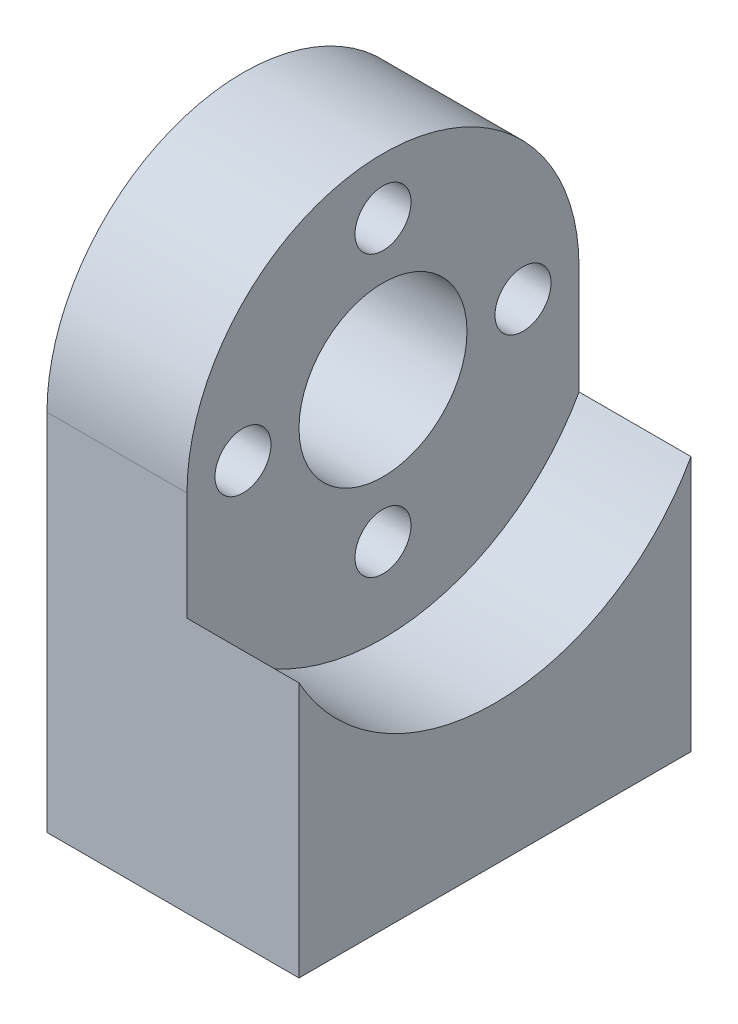
ISO-10303-21;
HEADER;
FILE_DESCRIPTION(('STEP AP214'),'2;1');
FILE_NAME('part.step','',(''),(''),'','','');
FILE_SCHEMA(('AUTOMOTIVE_DESIGN { 1 0 10303 214 1 1 1 1 }'));
ENDSEC;
DATA;
#1=APPLICATION_CONTEXT('core data for automotive mechanical design processes');
#2=APPLICATION_PROTOCOL_DEFINITION('international standard','automotive_design',2000,#1);
#3=PRODUCT_CONTEXT('',#1,'mechanical');
#4=PRODUCT('Part','Part','',(#3));
#5=PRODUCT_RELATED_PRODUCT_CATEGORY('part','',(#4));
#6=PRODUCT_DEFINITION_FORMATION('','',#4);
#7=PRODUCT_DEFINITION_CONTEXT('part definition',#1,'design');
#8=PRODUCT_DEFINITION('design','',#6,#7);
#9=PRODUCT_DEFINITION_SHAPE('','',#8);
#10=(LENGTH_UNIT() NAMED_UNIT(*) SI_UNIT(.MILLI.,.METRE.));
#11=(NAMED_UNIT(*) PLANE_ANGLE_UNIT() SI_UNIT($,.RADIAN.));
#12=(NAMED_UNIT(*) SI_UNIT($,.STERADIAN.) SOLID_ANGLE_UNIT());
#13=UNCERTAINTY_MEASURE_WITH_UNIT(LENGTH_MEASURE(1.E-05),#10,'distance_accuracy_value','');
#14=(GEOMETRIC_REPRESENTATION_CONTEXT(3) GLOBAL_UNCERTAINTY_ASSIGNED_CONTEXT((#13)) GLOBAL_UNIT_ASSIGNED_CONTEXT((#10,
#11,#12)) REPRESENTATION_CONTEXT('',''));
#15=CARTESIAN_POINT('',(0.,0.,0.));
#16=DIRECTION('',(0.,0.,1.));
#17=DIRECTION('',(1.,0.,0.));
#18=AXIS2_PLACEMENT_3D('',#15,#16,#17);
#19=CARTESIAN_POINT('',(0.,13.,-7.));
#20=DIRECTION('',(-1.,0.,0.));
#21=DIRECTION('',(0.,0.,1.));
#22=AXIS2_PLACEMENT_3D('',#19,#20,#21);
#23=PLANE('',#22);
#24=CARTESIAN_POINT('',(0.,13.,-7.));
#25=DIRECTION('',(1.,0.,0.));
#26=DIRECTION('',(0.,0.,1.));
#27=AXIS2_PLACEMENT_3D('',#24,#25,#26);
#28=CIRCLE('',#27,7.);
#29=CARTESIAN_POINT('',(0.,13.,-14.));
#30=VERTEX_POINT('',#29);
#31=CARTESIAN_POINT('',(0.,20.,-6.99999999999998));
#32=VERTEX_POINT('',#31);
#33=EDGE_CURVE('E159',#30,#32,#28,.T.);
#34=ORIENTED_EDGE('',*,*,#33,.F.);
#35=CARTESIAN_POINT('',(0.,13.,-12.));
#36=DIRECTION('',(-1.,0.,0.));
#37=DIRECTION('',(0.,0.,1.));
#38=AXIS2_PLACEMENT_3D('',#35,#36,#37);
#39=CIRCLE('',#38,2.00000000000001);
#40=CARTESIAN_POINT('',(0.,13.,-10.));
#41=VERTEX_POINT('',#40);
#42=EDGE_CURVE('E204',#30,#41,#39,.F.);
#43=ORIENTED_EDGE('',*,*,#42,.T.);
#44=CARTESIAN_POINT('',(0.,13.,-7.));
#45=DIRECTION('',(1.,0.,0.));
#46=DIRECTION('',(0.,0.,-1.));
#47=AXIS2_PLACEMENT_3D('',#44,#45,#46);
#48=CIRCLE('',#47,3.);
#49=CARTESIAN_POINT('',(0.,16.,-6.99999999999999));
#50=VERTEX_POINT('',#49);
#51=EDGE_CURVE('E146',#41,#50,#48,.T.);
#52=ORIENTED_EDGE('',*,*,#51,.T.);
#53=CARTESIAN_POINT('',(0.,18.,-6.99999999999999));
#54=DIRECTION('',(-1.,0.,0.));
#55=DIRECTION('',(0.,0.,1.));
#56=AXIS2_PLACEMENT_3D('',#53,#54,#55);
#57=CIRCLE('',#56,2.);
#58=EDGE_CURVE('E48',#50,#32,#57,.F.);
#59=ORIENTED_EDGE('',*,*,#58,.T.);
#60=EDGE_LOOP('',(#34,#43,#52,#59));
#61=FACE_BOUND('',#60,.T.);
#62=ADVANCED_FACE('F33',(#61),#23,.T.);
#63=CARTESIAN_POINT('',(0.,13.,-4.));
#64=VERTEX_POINT('',#63);
#65=CARTESIAN_POINT('',(0.,10.,-7.00000000000003));
#66=VERTEX_POINT('',#65);
#67=EDGE_CURVE('E232',#64,#66,#48,.T.);
#68=ORIENTED_EDGE('',*,*,#67,.T.);
#69=CARTESIAN_POINT('',(0.,8.,-7.00000000000005));
#70=DIRECTION('',(-1.,0.,0.));
#71=DIRECTION('',(0.,0.,1.));
#72=AXIS2_PLACEMENT_3D('',#69,#70,#71);
#73=CIRCLE('',#72,2.00000000000001);
#74=EDGE_CURVE('E54',#66,#66,#73,.F.);
#75=ORIENTED_EDGE('',*,*,#74,.T.);
#76=EDGE_CURVE('E145',#66,#41,#48,.T.);
#77=ORIENTED_EDGE('',*,*,#76,.T.);
#78=CARTESIAN_POINT('',(0.,13.,-12.));
#79=DIRECTION('',(-1.,0.,0.));
#80=DIRECTION('',(0.,0.,1.));
#81=AXIS2_PLACEMENT_3D('',#78,#79,#80);
#82=CIRCLE('',#81,2.00000000000001);
#83=EDGE_CURVE('E202',#41,#30,#82,.F.);
#84=ORIENTED_EDGE('',*,*,#83,.T.);
#85=DIRECTION('',(0.,1.,0.));
#86=VECTOR('',#85,1.);
#87=CARTESIAN_POINT('',(0.,0.,-14.));
#88=LINE('',#87,#86);
#89=CARTESIAN_POINT('',(0.,0.,-14.));
#90=VERTEX_POINT('',#89);
#91=EDGE_CURVE('E153',#90,#30,#88,.T.);
#92=ORIENTED_EDGE('',*,*,#91,.F.);
#93=DIRECTION('',(0.,0.,-1.));
#94=VECTOR('',#93,1.);
#95=CARTESIAN_POINT('',(0.,0.,0.));
#96=LINE('',#95,#94);
#97=CARTESIAN_POINT('',(0.,0.,0.));
#98=VERTEX_POINT('',#97);
#99=EDGE_CURVE('E164',#98,#90,#96,.T.);
#100=ORIENTED_EDGE('',*,*,#99,.F.);
#101=DIRECTION('',(0.,-1.,0.));
#102=VECTOR('',#101,1.);
#103=CARTESIAN_POINT('',(0.,13.,0.));
#104=LINE('',#103,#102);
#105=CARTESIAN_POINT('',(0.,13.,0.));
#106=VERTEX_POINT('',#105);
#107=EDGE_CURVE('E162',#106,#98,#104,.T.);
#108=ORIENTED_EDGE('',*,*,#107,.F.);
#109=CARTESIAN_POINT('',(0.,13.,-2.));
#110=DIRECTION('',(-1.,0.,0.));
#111=DIRECTION('',(0.,0.,1.));
#112=AXIS2_PLACEMENT_3D('',#109,#110,#111);
#113=CIRCLE('',#112,2.00000000000001);
#114=EDGE_CURVE('E199',#106,#64,#113,.F.);
#115=ORIENTED_EDGE('',*,*,#114,.T.);
#116=EDGE_LOOP('',(#68,#75,#77,#84,#92,#100,#108,#115));
#117=FACE_BOUND('',#116,.T.);
#118=ADVANCED_FACE('F231',(#117),#23,.T.);
#119=CARTESIAN_POINT('',(9.,8.,-7.00000000000005));
#120=DIRECTION('',(-1.,0.,0.));
#121=DIRECTION('',(0.,1.,0.));
#122=AXIS2_PLACEMENT_3D('',#119,#120,#121);
#123=CYLINDRICAL_SURFACE('',#122,1.);
#124=CARTESIAN_POINT('',(1.00000000000001,8.,-7.00000000000005));
#125=DIRECTION('',(-1.,0.,0.));
#126=DIRECTION('',(0.,0.,1.));
#127=AXIS2_PLACEMENT_3D('',#124,#125,#126);
#128=CIRCLE('',#127,1.);
#129=CARTESIAN_POINT('',(1.00000000000001,8.,-6.00000000000005));
#130=VERTEX_POINT('',#129);
#131=EDGE_CURVE('E208',#130,#130,#128,.T.);
#132=ORIENTED_EDGE('',*,*,#131,.T.);
#133=EDGE_LOOP('',(#132));
#134=FACE_BOUND('',#133,.T.);
#135=CARTESIAN_POINT('',(5.,8.,-7.00000000000005));
#136=DIRECTION('',(1.,0.,0.));
#137=DIRECTION('',(0.,-1.,0.));
#138=AXIS2_PLACEMENT_3D('',#135,#136,#137);
#139=CIRCLE('',#138,1.);
#140=CARTESIAN_POINT('',(5.,6.99999999999999,-7.00000000000006));
#141=VERTEX_POINT('',#140);
#142=EDGE_CURVE('E190',#141,#141,#139,.T.);
#143=ORIENTED_EDGE('',*,*,#142,.T.);
#144=EDGE_LOOP('',(#143));
#145=FACE_BOUND('',#144,.T.);
#146=ADVANCED_FACE('F254',(#134,#145),#123,.F.);
#147=CARTESIAN_POINT('',(9.,13.,-2.));
#148=DIRECTION('',(-1.,0.,0.));
#149=DIRECTION('',(0.,0.,-1.));
#150=AXIS2_PLACEMENT_3D('',#147,#148,#149);
#151=CYLINDRICAL_SURFACE('',#150,1.);
#152=CARTESIAN_POINT('',(1.00000000000001,13.,-2.));
#153=DIRECTION('',(-1.,0.,0.));
#154=DIRECTION('',(0.,0.,1.));
#155=AXIS2_PLACEMENT_3D('',#152,#153,#154);
#156=CIRCLE('',#155,1.);
#157=CARTESIAN_POINT('',(1.00000000000001,13.,-0.999999999999999));
#158=VERTEX_POINT('',#157);
#159=EDGE_CURVE('E41',#158,#158,#156,.T.);
#160=ORIENTED_EDGE('',*,*,#159,.T.);
#161=EDGE_LOOP('',(#160));
#162=FACE_BOUND('',#161,.T.);
#163=CARTESIAN_POINT('',(5.,13.,-2.));
#164=DIRECTION('',(1.,0.,0.));
#165=DIRECTION('',(0.,0.,1.));
#166=AXIS2_PLACEMENT_3D('',#163,#164,#165);
#167=CIRCLE('',#166,1.);
#168=CARTESIAN_POINT('',(5.,13.,-0.999999999999999));
#169=VERTEX_POINT('',#168);
#170=EDGE_CURVE('E187',#169,#169,#167,.T.);
#171=ORIENTED_EDGE('',*,*,#170,.T.);
#172=EDGE_LOOP('',(#171));
#173=FACE_BOUND('',#172,.T.);
#174=ADVANCED_FACE('F216',(#162,#173),#151,.F.);
#175=CARTESIAN_POINT('',(9.,18.,-6.99999999999999));
#176=DIRECTION('',(-1.,0.,0.));
#177=DIRECTION('',(0.,-1.,0.));
#178=AXIS2_PLACEMENT_3D('',#175,#176,#177);
#179=CYLINDRICAL_SURFACE('',#178,1.);
#180=CARTESIAN_POINT('',(1.,18.,-6.99999999999999));
#181=DIRECTION('',(-1.,0.,0.));
#182=DIRECTION('',(0.,0.,1.));
#183=AXIS2_PLACEMENT_3D('',#180,#181,#182);
#184=CIRCLE('',#183,1.);
#185=CARTESIAN_POINT('',(1.,18.,-5.99999999999998));
#186=VERTEX_POINT('',#185);
#187=EDGE_CURVE('E11',#186,#186,#184,.T.);
#188=ORIENTED_EDGE('',*,*,#187,.T.);
#189=EDGE_LOOP('',(#188));
#190=FACE_BOUND('',#189,.T.);
#191=CARTESIAN_POINT('',(5.,18.,-6.99999999999999));
#192=DIRECTION('',(1.,0.,0.));
#193=DIRECTION('',(0.,1.,0.));
#194=AXIS2_PLACEMENT_3D('',#191,#192,#193);
#195=CIRCLE('',#194,1.);
#196=CARTESIAN_POINT('',(5.,19.,-6.99999999999998));
#197=VERTEX_POINT('',#196);
#198=EDGE_CURVE('E184',#197,#197,#195,.T.);
#199=ORIENTED_EDGE('',*,*,#198,.T.);
#200=EDGE_LOOP('',(#199));
#201=FACE_BOUND('',#200,.T.);
#202=ADVANCED_FACE('F371',(#190,#201),#179,.F.);
#203=CARTESIAN_POINT('',(9.,13.,-7.));
#204=DIRECTION('',(-1.,0.,0.));
#205=DIRECTION('',(0.,0.,1.));
#206=AXIS2_PLACEMENT_3D('',#203,#204,#205);
#207=CYLINDRICAL_SURFACE('',#206,7.);
#208=CARTESIAN_POINT('',(5.,13.,-7.));
#209=DIRECTION('',(1.,0.,0.));
#210=DIRECTION('',(0.,0.,-1.));
#211=AXIS2_PLACEMENT_3D('',#208,#209,#210);
#212=CIRCLE('',#211,7.);
#213=CARTESIAN_POINT('',(5.,13.,-14.));
#214=VERTEX_POINT('',#213);
#215=CARTESIAN_POINT('',(5.,13.,0.));
#216=VERTEX_POINT('',#215);
#217=EDGE_CURVE('E138',#214,#216,#212,.T.);
#218=ORIENTED_EDGE('',*,*,#217,.F.);
#219=DIRECTION('',(-1.,0.,0.));
#220=VECTOR('',#219,1.);
#221=CARTESIAN_POINT('',(9.,13.,-14.));
#222=LINE('',#221,#220);
#223=EDGE_CURVE('E158',#214,#30,#222,.T.);
#224=ORIENTED_EDGE('',*,*,#223,.T.);
#225=ORIENTED_EDGE('',*,*,#33,.T.);
#226=EDGE_CURVE('E148',#32,#106,#28,.T.);
#227=ORIENTED_EDGE('',*,*,#226,.T.);
#228=DIRECTION('',(-1.,0.,0.));
#229=VECTOR('',#228,1.);
#230=CARTESIAN_POINT('',(9.,13.,0.));
#231=LINE('',#230,#229);
#232=EDGE_CURVE('E176',#216,#106,#231,.T.);
#233=ORIENTED_EDGE('',*,*,#232,.F.);
#234=EDGE_LOOP('',(#218,#224,#225,#227,#233));
#235=FACE_BOUND('',#234,.T.);
#236=ADVANCED_FACE('F276',(#235),#207,.T.);
#237=CARTESIAN_POINT('',(9.,13.,-7.));
#238=DIRECTION('',(-1.,0.,0.));
#239=DIRECTION('',(0.,0.,1.));
#240=AXIS2_PLACEMENT_3D('',#237,#238,#239);
#241=CYLINDRICAL_SURFACE('',#240,3.);
#242=ORIENTED_EDGE('',*,*,#51,.F.);
#243=ORIENTED_EDGE('',*,*,#76,.F.);
#244=ORIENTED_EDGE('',*,*,#67,.F.);
#245=EDGE_CURVE('E149',#50,#64,#48,.T.);
#246=ORIENTED_EDGE('',*,*,#245,.F.);
#247=EDGE_LOOP('',(#242,#243,#244,#246));
#248=FACE_BOUND('',#247,.T.);
#249=CARTESIAN_POINT('',(5.,13.,-7.));
#250=DIRECTION('',(1.,0.,0.));
#251=DIRECTION('',(0.,0.,-1.));
#252=AXIS2_PLACEMENT_3D('',#249,#250,#251);
#253=CIRCLE('',#252,3.);
#254=CARTESIAN_POINT('',(5.,13.,-10.));
#255=VERTEX_POINT('',#254);
#256=EDGE_CURVE('E133',#255,#255,#253,.T.);
#257=ORIENTED_EDGE('',*,*,#256,.T.);
#258=EDGE_LOOP('',(#257));
#259=FACE_BOUND('',#258,.T.);
#260=ADVANCED_FACE('F238',(#248,#259),#241,.F.);
#261=CARTESIAN_POINT('',(9.,13.,-12.));
#262=DIRECTION('',(-1.,0.,0.));
#263=DIRECTION('',(0.,0.,1.));
#264=AXIS2_PLACEMENT_3D('',#261,#262,#263);
#265=CYLINDRICAL_SURFACE('',#264,1.);
#266=CARTESIAN_POINT('',(1.00000000000001,13.,-12.));
#267=DIRECTION('',(-1.,0.,0.));
#268=DIRECTION('',(0.,0.,1.));
#269=AXIS2_PLACEMENT_3D('',#266,#267,#268);
#270=CIRCLE('',#269,1.);
#271=CARTESIAN_POINT('',(1.00000000000001,13.,-11.));
#272=VERTEX_POINT('',#271);
#273=EDGE_CURVE('E211',#272,#272,#270,.T.);
#274=ORIENTED_EDGE('',*,*,#273,.T.);
#275=EDGE_LOOP('',(#274));
#276=FACE_BOUND('',#275,.T.);
#277=CARTESIAN_POINT('',(5.,13.,-12.));
#278=DIRECTION('',(1.,0.,0.));
#279=DIRECTION('',(0.,0.,-1.));
#280=AXIS2_PLACEMENT_3D('',#277,#278,#279);
#281=CIRCLE('',#280,1.);
#282=CARTESIAN_POINT('',(5.,13.,-13.));
#283=VERTEX_POINT('',#282);
#284=EDGE_CURVE('E131',#283,#283,#281,.T.);
#285=ORIENTED_EDGE('',*,*,#284,.T.);
#286=EDGE_LOOP('',(#285));
#287=FACE_BOUND('',#286,.T.);
#288=ADVANCED_FACE('F267',(#276,#287),#265,.F.);
#289=CARTESIAN_POINT('',(9.,13.,-7.));
#290=DIRECTION('',(-1.,0.,0.));
#291=DIRECTION('',(0.,0.,1.));
#292=AXIS2_PLACEMENT_3D('',#289,#290,#291);
#293=PLANE('',#292);
#294=DIRECTION('',(0.,1.,0.));
#295=VECTOR('',#294,1.);
#296=CARTESIAN_POINT('',(9.,0.,-14.));
#297=LINE('',#296,#295);
#298=CARTESIAN_POINT('',(9.,0.,-14.));
#299=VERTEX_POINT('',#298);
#300=CARTESIAN_POINT('',(9.,9.12701665379258,-14.));
#301=VERTEX_POINT('',#300);
#302=EDGE_CURVE('E155',#299,#301,#297,.T.);
#303=ORIENTED_EDGE('',*,*,#302,.T.);
#304=CARTESIAN_POINT('',(9.,13.,-7.));
#305=DIRECTION('',(1.,0.,0.));
#306=DIRECTION('',(0.,0.,-1.));
#307=AXIS2_PLACEMENT_3D('',#304,#305,#306);
#308=CIRCLE('',#307,8.);
#309=CARTESIAN_POINT('',(9.,9.12701665379258,0.));
#310=VERTEX_POINT('',#309);
#311=EDGE_CURVE('E128',#310,#301,#308,.T.);
#312=ORIENTED_EDGE('',*,*,#311,.F.);
#313=DIRECTION('',(0.,-1.,0.));
#314=VECTOR('',#313,1.);
#315=CARTESIAN_POINT('',(9.,13.,0.));
#316=LINE('',#315,#314);
#317=CARTESIAN_POINT('',(9.,0.,0.));
#318=VERTEX_POINT('',#317);
#319=EDGE_CURVE('E150',#310,#318,#316,.T.);
#320=ORIENTED_EDGE('',*,*,#319,.T.);
#321=DIRECTION('',(0.,0.,-1.));
#322=VECTOR('',#321,1.);
#323=CARTESIAN_POINT('',(9.,0.,0.));
#324=LINE('',#323,#322);
#325=EDGE_CURVE('E152',#318,#299,#324,.T.);
#326=ORIENTED_EDGE('',*,*,#325,.T.);
#327=EDGE_LOOP('',(#303,#312,#320,#326));
#328=FACE_BOUND('',#327,.T.);
#329=ADVANCED_FACE('F259',(#328),#293,.F.);
#330=ORIENTED_EDGE('',*,*,#245,.T.);
#331=CARTESIAN_POINT('',(0.,13.,-2.));
#332=DIRECTION('',(-1.,0.,0.));
#333=DIRECTION('',(0.,0.,1.));
#334=AXIS2_PLACEMENT_3D('',#331,#332,#333);
#335=CIRCLE('',#334,2.00000000000001);
#336=EDGE_CURVE('E197',#64,#106,#335,.F.);
#337=ORIENTED_EDGE('',*,*,#336,.T.);
#338=ORIENTED_EDGE('',*,*,#226,.F.);
#339=CARTESIAN_POINT('',(0.,18.,-6.99999999999999));
#340=DIRECTION('',(-1.,0.,0.));
#341=DIRECTION('',(0.,0.,1.));
#342=AXIS2_PLACEMENT_3D('',#339,#340,#341);
#343=CIRCLE('',#342,2.);
#344=EDGE_CURVE('E194',#32,#50,#343,.F.);
#345=ORIENTED_EDGE('',*,*,#344,.T.);
#346=EDGE_LOOP('',(#330,#337,#338,#345));
#347=FACE_BOUND('',#346,.T.);
#348=ADVANCED_FACE('F241',(#347),#23,.T.);
#349=CARTESIAN_POINT('',(9.,13.,0.));
#350=DIRECTION('',(0.,0.,-1.));
#351=DIRECTION('',(0.,1.,0.));
#352=AXIS2_PLACEMENT_3D('',#349,#350,#351);
#353=PLANE('',#352);
#354=ORIENTED_EDGE('',*,*,#319,.F.);
#355=DIRECTION('',(1.,0.,0.));
#356=VECTOR('',#355,1.);
#357=CARTESIAN_POINT('',(5.,9.12701665379258,0.));
#358=LINE('',#357,#356);
#359=CARTESIAN_POINT('',(5.,9.12701665379258,0.));
#360=VERTEX_POINT('',#359);
#361=EDGE_CURVE('E142',#310,#360,#358,.F.);
#362=ORIENTED_EDGE('',*,*,#361,.T.);
#363=DIRECTION('',(0.,-1.,0.));
#364=VECTOR('',#363,1.);
#365=CARTESIAN_POINT('',(5.,13.,0.));
#366=LINE('',#365,#364);
#367=EDGE_CURVE('E140',#216,#360,#366,.T.);
#368=ORIENTED_EDGE('',*,*,#367,.F.);
#369=ORIENTED_EDGE('',*,*,#232,.T.);
#370=ORIENTED_EDGE('',*,*,#107,.T.);
#371=DIRECTION('',(-1.,0.,0.));
#372=VECTOR('',#371,1.);
#373=CARTESIAN_POINT('',(9.,0.,0.));
#374=LINE('',#373,#372);
#375=EDGE_CURVE('E173',#318,#98,#374,.T.);
#376=ORIENTED_EDGE('',*,*,#375,.F.);
#377=EDGE_LOOP('',(#354,#362,#368,#369,#370,#376));
#378=FACE_BOUND('',#377,.T.);
#379=ADVANCED_FACE('F258',(#378),#353,.F.);
#380=CARTESIAN_POINT('',(9.,0.,0.));
#381=DIRECTION('',(0.,1.,0.));
#382=DIRECTION('',(0.,0.,1.));
#383=AXIS2_PLACEMENT_3D('',#380,#381,#382);
#384=PLANE('',#383);
#385=CARTESIAN_POINT('',(7.,0.,-11.));
#386=DIRECTION('',(0.,-1.,0.));
#387=DIRECTION('',(0.,0.,-1.));
#388=AXIS2_PLACEMENT_3D('',#385,#386,#387);
#389=CIRCLE('',#388,1.);
#390=CARTESIAN_POINT('',(7.,0.,-12.));
#391=VERTEX_POINT('',#390);
#392=EDGE_CURVE('E321',#391,#391,#389,.T.);
#393=ORIENTED_EDGE('',*,*,#392,.F.);
#394=EDGE_LOOP('',(#393));
#395=FACE_BOUND('',#394,.T.);
#396=CARTESIAN_POINT('',(3.,0.,-3.));
#397=DIRECTION('',(0.,-1.,0.));
#398=DIRECTION('',(0.,0.,-1.));
#399=AXIS2_PLACEMENT_3D('',#396,#397,#398);
#400=CIRCLE('',#399,0.999999999999999);
#401=CARTESIAN_POINT('',(3.,0.,-4.));
#402=VERTEX_POINT('',#401);
#403=EDGE_CURVE('E320',#402,#402,#400,.T.);
#404=ORIENTED_EDGE('',*,*,#403,.F.);
#405=EDGE_LOOP('',(#404));
#406=FACE_BOUND('',#405,.T.);
#407=CARTESIAN_POINT('',(3.,0.,-11.));
#408=DIRECTION('',(0.,-1.,0.));
#409=DIRECTION('',(0.,0.,-1.));
#410=AXIS2_PLACEMENT_3D('',#407,#408,#409);
#411=CIRCLE('',#410,1.25);
#412=CARTESIAN_POINT('',(3.,0.,-12.25));
#413=VERTEX_POINT('',#412);
#414=EDGE_CURVE('E116',#413,#413,#411,.T.);
#415=ORIENTED_EDGE('',*,*,#414,.F.);
#416=EDGE_LOOP('',(#415));
#417=FACE_BOUND('',#416,.T.);
#418=CARTESIAN_POINT('',(7.,0.,-3.));
#419=DIRECTION('',(0.,-1.,0.));
#420=DIRECTION('',(0.,0.,-1.));
#421=AXIS2_PLACEMENT_3D('',#418,#419,#420);
#422=CIRCLE('',#421,1.25);
#423=CARTESIAN_POINT('',(7.,0.,-4.25));
#424=VERTEX_POINT('',#423);
#425=EDGE_CURVE('E115',#424,#424,#422,.T.);
#426=ORIENTED_EDGE('',*,*,#425,.F.);
#427=EDGE_LOOP('',(#426));
#428=FACE_BOUND('',#427,.T.);
#429=ORIENTED_EDGE('',*,*,#99,.T.);
#430=DIRECTION('',(-1.,0.,0.));
#431=VECTOR('',#430,1.);
#432=CARTESIAN_POINT('',(9.,0.,-14.));
#433=LINE('',#432,#431);
#434=EDGE_CURVE('E170',#299,#90,#433,.T.);
#435=ORIENTED_EDGE('',*,*,#434,.F.);
#436=ORIENTED_EDGE('',*,*,#325,.F.);
#437=ORIENTED_EDGE('',*,*,#375,.T.);
#438=EDGE_LOOP('',(#429,#435,#436,#437));
#439=FACE_BOUND('',#438,.T.);
#440=ADVANCED_FACE('F264',(#395,#406,#417,#428,#439),#384,.F.);
#441=CARTESIAN_POINT('',(9.,0.,-14.));
#442=DIRECTION('',(0.,0.,1.));
#443=DIRECTION('',(0.,-1.,0.));
#444=AXIS2_PLACEMENT_3D('',#441,#442,#443);
#445=PLANE('',#444);
#446=DIRECTION('',(0.,1.,0.));
#447=VECTOR('',#446,1.);
#448=CARTESIAN_POINT('',(5.,0.,-14.));
#449=LINE('',#448,#447);
#450=CARTESIAN_POINT('',(5.,9.12701665379258,-14.));
#451=VERTEX_POINT('',#450);
#452=EDGE_CURVE('E136',#451,#214,#449,.T.);
#453=ORIENTED_EDGE('',*,*,#452,.F.);
#454=DIRECTION('',(1.,0.,0.));
#455=VECTOR('',#454,1.);
#456=CARTESIAN_POINT('',(5.,9.12701665379258,-14.));
#457=LINE('',#456,#455);
#458=EDGE_CURVE('E179',#451,#301,#457,.T.);
#459=ORIENTED_EDGE('',*,*,#458,.T.);
#460=ORIENTED_EDGE('',*,*,#302,.F.);
#461=ORIENTED_EDGE('',*,*,#434,.T.);
#462=ORIENTED_EDGE('',*,*,#91,.T.);
#463=ORIENTED_EDGE('',*,*,#223,.F.);
#464=EDGE_LOOP('',(#453,#459,#460,#461,#462,#463));
#465=FACE_BOUND('',#464,.T.);
#466=ADVANCED_FACE('F282',(#465),#445,.F.);
#467=CARTESIAN_POINT('',(5.,13.,-7.));
#468=DIRECTION('',(1.,0.,0.));
#469=DIRECTION('',(0.,0.,-1.));
#470=AXIS2_PLACEMENT_3D('',#467,#468,#469);
#471=CYLINDRICAL_SURFACE('',#470,8.);
#472=ORIENTED_EDGE('',*,*,#311,.T.);
#473=ORIENTED_EDGE('',*,*,#458,.F.);
#474=CARTESIAN_POINT('',(5.,13.,-7.));
#475=DIRECTION('',(1.,0.,0.));
#476=DIRECTION('',(0.,0.,-1.));
#477=AXIS2_PLACEMENT_3D('',#474,#475,#476);
#478=CIRCLE('',#477,8.);
#479=EDGE_CURVE('E129',#360,#451,#478,.T.);
#480=ORIENTED_EDGE('',*,*,#479,.F.);
#481=ORIENTED_EDGE('',*,*,#361,.F.);
#482=EDGE_LOOP('',(#472,#473,#480,#481));
#483=FACE_BOUND('',#482,.T.);
#484=ADVANCED_FACE('F278',(#483),#471,.F.);
#485=CARTESIAN_POINT('',(5.,13.,-7.));
#486=DIRECTION('',(1.,0.,0.));
#487=DIRECTION('',(0.,0.,-1.));
#488=AXIS2_PLACEMENT_3D('',#485,#486,#487);
#489=PLANE('',#488);
#490=ORIENTED_EDGE('',*,*,#142,.F.);
#491=EDGE_LOOP('',(#490));
#492=FACE_BOUND('',#491,.T.);
#493=ORIENTED_EDGE('',*,*,#170,.F.);
#494=EDGE_LOOP('',(#493));
#495=FACE_BOUND('',#494,.T.);
#496=ORIENTED_EDGE('',*,*,#198,.F.);
#497=EDGE_LOOP('',(#496));
#498=FACE_BOUND('',#497,.T.);
#499=ORIENTED_EDGE('',*,*,#284,.F.);
#500=EDGE_LOOP('',(#499));
#501=FACE_BOUND('',#500,.T.);
#502=ORIENTED_EDGE('',*,*,#256,.F.);
#503=EDGE_LOOP('',(#502));
#504=FACE_BOUND('',#503,.T.);
#505=ORIENTED_EDGE('',*,*,#367,.T.);
#506=ORIENTED_EDGE('',*,*,#479,.T.);
#507=ORIENTED_EDGE('',*,*,#452,.T.);
#508=ORIENTED_EDGE('',*,*,#217,.T.);
#509=EDGE_LOOP('',(#505,#506,#507,#508));
#510=FACE_BOUND('',#509,.T.);
#511=ADVANCED_FACE('F281',(#492,#495,#498,#501,#504,#510),#489,.T.);
#512=CARTESIAN_POINT('',(7.,4.,-3.));
#513=DIRECTION('',(0.,-1.,0.));
#514=DIRECTION('',(0.,0.,-1.));
#515=AXIS2_PLACEMENT_3D('',#512,#513,#514);
#516=CONICAL_SURFACE('',#515,1.25,1.02974425867665);
#517=CARTESIAN_POINT('',(7.,4.75107577378445,-3.));
#518=VERTEX_POINT('',#517);
#519=VERTEX_LOOP('',#518);
#520=FACE_BOUND('',#519,.T.);
#521=CARTESIAN_POINT('',(7.,4.,-3.));
#522=DIRECTION('',(0.,-1.,0.));
#523=DIRECTION('',(0.,0.,-1.));
#524=AXIS2_PLACEMENT_3D('',#521,#522,#523);
#525=CIRCLE('',#524,1.25);
#526=CARTESIAN_POINT('',(7.,4.,-4.25));
#527=VERTEX_POINT('',#526);
#528=EDGE_CURVE('E119',#527,#527,#525,.T.);
#529=ORIENTED_EDGE('',*,*,#528,.T.);
#530=EDGE_LOOP('',(#529));
#531=FACE_BOUND('',#530,.T.);
#532=ADVANCED_FACE('F286',(#520,#531),#516,.F.);
#533=CARTESIAN_POINT('',(7.,0.,-3.));
#534=DIRECTION('',(0.,-1.,0.));
#535=DIRECTION('',(0.,0.,-1.));
#536=AXIS2_PLACEMENT_3D('',#533,#534,#535);
#537=CYLINDRICAL_SURFACE('',#536,1.25);
#538=ORIENTED_EDGE('',*,*,#528,.F.);
#539=EDGE_LOOP('',(#538));
#540=FACE_BOUND('',#539,.T.);
#541=ORIENTED_EDGE('',*,*,#425,.T.);
#542=EDGE_LOOP('',(#541));
#543=FACE_BOUND('',#542,.T.);
#544=ADVANCED_FACE('F109',(#540,#543),#537,.F.);
#545=CARTESIAN_POINT('',(3.,4.,-11.));
#546=DIRECTION('',(0.,-1.,0.));
#547=DIRECTION('',(0.,0.,-1.));
#548=AXIS2_PLACEMENT_3D('',#545,#546,#547);
#549=CONICAL_SURFACE('',#548,1.25,1.02974425867665);
#550=CARTESIAN_POINT('',(3.,4.75107577378445,-11.));
#551=VERTEX_POINT('',#550);
#552=VERTEX_LOOP('',#551);
#553=FACE_BOUND('',#552,.T.);
#554=CARTESIAN_POINT('',(3.,4.,-11.));
#555=DIRECTION('',(0.,-1.,0.));
#556=DIRECTION('',(0.,0.,-1.));
#557=AXIS2_PLACEMENT_3D('',#554,#555,#556);
#558=CIRCLE('',#557,1.25);
#559=CARTESIAN_POINT('',(3.,4.,-12.25));
#560=VERTEX_POINT('',#559);
#561=EDGE_CURVE('E113',#560,#560,#558,.T.);
#562=ORIENTED_EDGE('',*,*,#561,.T.);
#563=EDGE_LOOP('',(#562));
#564=FACE_BOUND('',#563,.T.);
#565=ADVANCED_FACE('F105',(#553,#564),#549,.F.);
#566=CARTESIAN_POINT('',(3.,0.,-11.));
#567=DIRECTION('',(0.,-1.,0.));
#568=DIRECTION('',(0.,0.,-1.));
#569=AXIS2_PLACEMENT_3D('',#566,#567,#568);
#570=CYLINDRICAL_SURFACE('',#569,1.25);
#571=ORIENTED_EDGE('',*,*,#561,.F.);
#572=EDGE_LOOP('',(#571));
#573=FACE_BOUND('',#572,.T.);
#574=ORIENTED_EDGE('',*,*,#414,.T.);
#575=EDGE_LOOP('',(#574));
#576=FACE_BOUND('',#575,.T.);
#577=ADVANCED_FACE('F108',(#573,#576),#570,.F.);
#578=CARTESIAN_POINT('',(3.,4.,-3.));
#579=DIRECTION('',(0.,-1.,0.));
#580=DIRECTION('',(0.,0.,-1.));
#581=AXIS2_PLACEMENT_3D('',#578,#579,#580);
#582=CYLINDRICAL_SURFACE('',#581,0.999999999999999);
#583=CARTESIAN_POINT('',(3.,4.,-3.));
#584=DIRECTION('',(0.,-1.,0.));
#585=DIRECTION('',(0.,0.,-1.));
#586=AXIS2_PLACEMENT_3D('',#583,#584,#585);
#587=CIRCLE('',#586,0.999999999999999);
#588=CARTESIAN_POINT('',(3.,4.,-4.));
#589=VERTEX_POINT('',#588);
#590=EDGE_CURVE('E122',#589,#589,#587,.T.);
#591=ORIENTED_EDGE('',*,*,#590,.F.);
#592=EDGE_LOOP('',(#591));
#593=FACE_BOUND('',#592,.T.);
#594=ORIENTED_EDGE('',*,*,#403,.T.);
#595=EDGE_LOOP('',(#594));
#596=FACE_BOUND('',#595,.T.);
#597=ADVANCED_FACE('F296',(#593,#596),#582,.F.);
#598=CARTESIAN_POINT('',(3.,4.,-3.));
#599=DIRECTION('',(0.,-1.,0.));
#600=DIRECTION('',(0.,0.,-1.));
#601=AXIS2_PLACEMENT_3D('',#598,#599,#600);
#602=PLANE('',#601);
#603=ORIENTED_EDGE('',*,*,#590,.T.);
#604=EDGE_LOOP('',(#603));
#605=FACE_BOUND('',#604,.T.);
#606=ADVANCED_FACE('F299',(#605),#602,.T.);
#607=CARTESIAN_POINT('',(7.,4.,-11.));
#608=DIRECTION('',(0.,-1.,0.));
#609=DIRECTION('',(0.,0.,-1.));
#610=AXIS2_PLACEMENT_3D('',#607,#608,#609);
#611=CYLINDRICAL_SURFACE('',#610,1.);
#612=CARTESIAN_POINT('',(7.,4.,-11.));
#613=DIRECTION('',(0.,-1.,0.));
#614=DIRECTION('',(0.,0.,-1.));
#615=AXIS2_PLACEMENT_3D('',#612,#613,#614);
#616=CIRCLE('',#615,1.);
#617=CARTESIAN_POINT('',(7.,4.,-12.));
#618=VERTEX_POINT('',#617);
#619=EDGE_CURVE('E319',#618,#618,#616,.T.);
#620=ORIENTED_EDGE('',*,*,#619,.F.);
#621=EDGE_LOOP('',(#620));
#622=FACE_BOUND('',#621,.T.);
#623=ORIENTED_EDGE('',*,*,#392,.T.);
#624=EDGE_LOOP('',(#623));
#625=FACE_BOUND('',#624,.T.);
#626=ADVANCED_FACE('F303',(#622,#625),#611,.F.);
#627=CARTESIAN_POINT('',(7.,4.,-11.));
#628=DIRECTION('',(0.,-1.,0.));
#629=DIRECTION('',(0.,0.,-1.));
#630=AXIS2_PLACEMENT_3D('',#627,#628,#629);
#631=PLANE('',#630);
#632=ORIENTED_EDGE('',*,*,#619,.T.);
#633=EDGE_LOOP('',(#632));
#634=FACE_BOUND('',#633,.T.);
#635=ADVANCED_FACE('F307',(#634),#631,.T.);
#636=CARTESIAN_POINT('',(0.,8.,-7.00000000000005));
#637=DIRECTION('',(-1.,0.,0.));
#638=DIRECTION('',(0.,0.,1.));
#639=AXIS2_PLACEMENT_3D('',#636,#637,#638);
#640=CONICAL_SURFACE('',#639,2.00000000000001,0.785398163397448);
#641=ORIENTED_EDGE('',*,*,#131,.F.);
#642=EDGE_LOOP('',(#641));
#643=FACE_BOUND('',#642,.T.);
#644=ORIENTED_EDGE('',*,*,#74,.F.);
#645=EDGE_LOOP('',(#644));
#646=FACE_BOUND('',#645,.T.);
#647=ADVANCED_FACE('F310',(#643,#646),#640,.F.);
#648=CARTESIAN_POINT('',(0.,13.,-12.));
#649=DIRECTION('',(-1.,0.,0.));
#650=DIRECTION('',(0.,0.,1.));
#651=AXIS2_PLACEMENT_3D('',#648,#649,#650);
#652=CONICAL_SURFACE('',#651,2.00000000000001,0.785398163397449);
#653=ORIENTED_EDGE('',*,*,#273,.F.);
#654=EDGE_LOOP('',(#653));
#655=FACE_BOUND('',#654,.T.);
#656=ORIENTED_EDGE('',*,*,#83,.F.);
#657=ORIENTED_EDGE('',*,*,#42,.F.);
#658=EDGE_LOOP('',(#656,#657));
#659=FACE_BOUND('',#658,.T.);
#660=ADVANCED_FACE('F222',(#655,#659),#652,.F.);
#661=CARTESIAN_POINT('',(0.,13.,-2.));
#662=DIRECTION('',(-1.,0.,0.));
#663=DIRECTION('',(0.,0.,1.));
#664=AXIS2_PLACEMENT_3D('',#661,#662,#663);
#665=CONICAL_SURFACE('',#664,2.00000000000001,0.785398163397448);
#666=ORIENTED_EDGE('',*,*,#159,.F.);
#667=EDGE_LOOP('',(#666));
#668=FACE_BOUND('',#667,.T.);
#669=ORIENTED_EDGE('',*,*,#336,.F.);
#670=ORIENTED_EDGE('',*,*,#114,.F.);
#671=EDGE_LOOP('',(#669,#670));
#672=FACE_BOUND('',#671,.T.);
#673=ADVANCED_FACE('F219',(#668,#672),#665,.F.);
#674=CARTESIAN_POINT('',(0.,18.,-6.99999999999999));
#675=DIRECTION('',(-1.,0.,0.));
#676=DIRECTION('',(0.,0.,1.));
#677=AXIS2_PLACEMENT_3D('',#674,#675,#676);
#678=CONICAL_SURFACE('',#677,2.,0.785398163397446);
#679=ORIENTED_EDGE('',*,*,#187,.F.);
#680=EDGE_LOOP('',(#679));
#681=FACE_BOUND('',#680,.T.);
#682=ORIENTED_EDGE('',*,*,#58,.F.);
#683=ORIENTED_EDGE('',*,*,#344,.F.);
#684=EDGE_LOOP('',(#682,#683));
#685=FACE_BOUND('',#684,.T.);
#686=ADVANCED_FACE('F35',(#681,#685),#678,.F.);
#687=CLOSED_SHELL('',(#62,#118,#146,#174,#202,#236,#260,#288,#329,#348,#379,#440,#466,#484,#511,
#532,#544,#565,#577,#597,#606,#626,#635,#647,#660,#673,#686));
#688=MANIFOLD_SOLID_BREP('B2',#687);
#689=ADVANCED_BREP_SHAPE_REPRESENTATION('',(#18,#688),#14);
#690=SHAPE_DEFINITION_REPRESENTATION(#9,#689);
ENDSEC;
END-ISO-10303-21;
